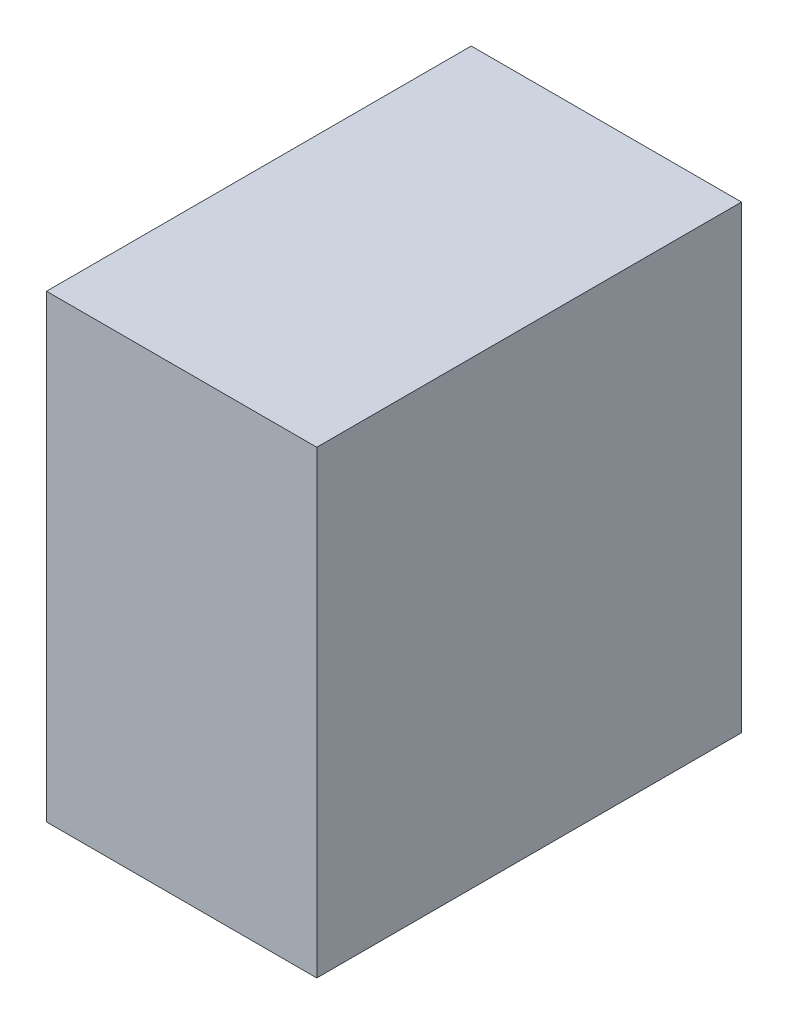
ISO-10303-21;
HEADER;
FILE_DESCRIPTION(('STEP AP214'),'2;1');
FILE_NAME('part.step','',(''),(''),'','','');
FILE_SCHEMA(('AUTOMOTIVE_DESIGN { 1 0 10303 214 1 1 1 1 }'));
ENDSEC;
DATA;
#1=APPLICATION_CONTEXT('core data for automotive mechanical design processes');
#2=APPLICATION_PROTOCOL_DEFINITION('international standard','automotive_design',2000,#1);
#3=PRODUCT_CONTEXT('',#1,'mechanical');
#4=PRODUCT('Part','Part','',(#3));
#5=PRODUCT_RELATED_PRODUCT_CATEGORY('part','',(#4));
#6=PRODUCT_DEFINITION_FORMATION('','',#4);
#7=PRODUCT_DEFINITION_CONTEXT('part definition',#1,'design');
#8=PRODUCT_DEFINITION('design','',#6,#7);
#9=PRODUCT_DEFINITION_SHAPE('','',#8);
#10=(LENGTH_UNIT() NAMED_UNIT(*) SI_UNIT(.MILLI.,.METRE.));
#11=(NAMED_UNIT(*) PLANE_ANGLE_UNIT() SI_UNIT($,.RADIAN.));
#12=(NAMED_UNIT(*) SI_UNIT($,.STERADIAN.) SOLID_ANGLE_UNIT());
#13=UNCERTAINTY_MEASURE_WITH_UNIT(LENGTH_MEASURE(1.E-05),#10,'distance_accuracy_value','');
#14=(GEOMETRIC_REPRESENTATION_CONTEXT(3) GLOBAL_UNCERTAINTY_ASSIGNED_CONTEXT((#13)) GLOBAL_UNIT_ASSIGNED_CONTEXT((#10,
#11,#12)) REPRESENTATION_CONTEXT('',''));
#15=CARTESIAN_POINT('',(0.,0.,0.));
#16=DIRECTION('',(0.,0.,1.));
#17=DIRECTION('',(1.,0.,0.));
#18=AXIS2_PLACEMENT_3D('',#15,#16,#17);
#19=CARTESIAN_POINT('',(40.3,20.3220000107563,7.27));
#20=DIRECTION('',(1.,0.,0.));
#21=DIRECTION('',(0.,1.,0.));
#22=AXIS2_PLACEMENT_3D('',#19,#20,#21);
#23=PLANE('',#22);
#24=DIRECTION('',(0.,0.,1.));
#25=VECTOR('',#24,1.);
#26=CARTESIAN_POINT('',(40.3,12.3220000107563,15.3525));
#27=LINE('',#26,#25);
#28=CARTESIAN_POINT('',(40.3,12.3220000107563,7.27));
#29=VERTEX_POINT('',#28);
#30=CARTESIAN_POINT('',(40.3,12.3220000107563,17.27));
#31=VERTEX_POINT('',#30);
#32=EDGE_CURVE('E80',#29,#31,#27,.T.);
#33=ORIENTED_EDGE('',*,*,#32,.T.);
#34=DIRECTION('',(0.,-1.,0.));
#35=VECTOR('',#34,1.);
#36=CARTESIAN_POINT('',(40.3,20.3220000107563,17.27));
#37=LINE('',#36,#35);
#38=CARTESIAN_POINT('',(40.3,1.49999995944139,17.27));
#39=VERTEX_POINT('',#38);
#40=EDGE_CURVE('E11',#31,#39,#37,.T.);
#41=ORIENTED_EDGE('',*,*,#40,.T.);
#42=DIRECTION('',(0.,0.,1.));
#43=VECTOR('',#42,1.);
#44=CARTESIAN_POINT('',(40.3,1.5,3.635));
#45=LINE('',#44,#43);
#46=CARTESIAN_POINT('',(40.3,1.49999995944139,7.27));
#47=VERTEX_POINT('',#46);
#48=EDGE_CURVE('E83',#47,#39,#45,.T.);
#49=ORIENTED_EDGE('',*,*,#48,.F.);
#50=DIRECTION('',(0.,-1.,0.));
#51=VECTOR('',#50,1.);
#52=CARTESIAN_POINT('',(40.3,20.3220000107563,7.27));
#53=LINE('',#52,#51);
#54=EDGE_CURVE('E27',#29,#47,#53,.T.);
#55=ORIENTED_EDGE('',*,*,#54,.F.);
#56=EDGE_LOOP('',(#33,#41,#49,#55));
#57=FACE_BOUND('',#56,.T.);
#58=ADVANCED_FACE('F16',(#57),#23,.T.);
#59=CARTESIAN_POINT('',(40.3,20.3220000107563,17.27));
#60=DIRECTION('',(0.,0.,1.));
#61=DIRECTION('',(0.,-1.,0.));
#62=AXIS2_PLACEMENT_3D('',#59,#60,#61);
#63=PLANE('',#62);
#64=DIRECTION('',(-1.,0.,0.));
#65=VECTOR('',#64,1.);
#66=CARTESIAN_POINT('',(39.2847851604859,12.3220000107563,17.27));
#67=LINE('',#66,#65);
#68=CARTESIAN_POINT('',(33.9369990081897,12.3220000107563,17.27));
#69=VERTEX_POINT('',#68);
#70=EDGE_CURVE('E90',#31,#69,#67,.T.);
#71=ORIENTED_EDGE('',*,*,#70,.T.);
#72=DIRECTION('',(0.,-1.,0.));
#73=VECTOR('',#72,1.);
#74=CARTESIAN_POINT('',(33.9369990081897,20.3220000107563,17.27));
#75=LINE('',#74,#73);
#76=CARTESIAN_POINT('',(33.9369990081897,1.49999995944139,17.27));
#77=VERTEX_POINT('',#76);
#78=EDGE_CURVE('E52',#69,#77,#75,.T.);
#79=ORIENTED_EDGE('',*,*,#78,.T.);
#80=DIRECTION('',(-1.,0.,0.));
#81=VECTOR('',#80,1.);
#82=CARTESIAN_POINT('',(20.15,1.5,17.27));
#83=LINE('',#82,#81);
#84=EDGE_CURVE('E96',#39,#77,#83,.T.);
#85=ORIENTED_EDGE('',*,*,#84,.F.);
#86=ORIENTED_EDGE('',*,*,#40,.F.);
#87=EDGE_LOOP('',(#71,#79,#85,#86));
#88=FACE_BOUND('',#87,.T.);
#89=ADVANCED_FACE('F122',(#88),#63,.T.);
#90=CARTESIAN_POINT('',(33.9369990081897,20.3220000107563,7.27));
#91=DIRECTION('',(0.,0.,-1.));
#92=DIRECTION('',(0.,-1.,0.));
#93=AXIS2_PLACEMENT_3D('',#90,#91,#92);
#94=PLANE('',#93);
#95=DIRECTION('',(1.,0.,0.));
#96=VECTOR('',#95,1.);
#97=CARTESIAN_POINT('',(36.1032846645808,12.3220000107563,7.27));
#98=LINE('',#97,#96);
#99=CARTESIAN_POINT('',(33.9369990081897,12.3220000107563,7.27));
#100=VERTEX_POINT('',#99);
#101=EDGE_CURVE('E89',#100,#29,#98,.T.);
#102=ORIENTED_EDGE('',*,*,#101,.T.);
#103=ORIENTED_EDGE('',*,*,#54,.T.);
#104=DIRECTION('',(1.,0.,0.));
#105=VECTOR('',#104,1.);
#106=CARTESIAN_POINT('',(16.9684995040948,1.5,7.27));
#107=LINE('',#106,#105);
#108=CARTESIAN_POINT('',(33.9369990081897,1.49999995944138,7.27));
#109=VERTEX_POINT('',#108);
#110=EDGE_CURVE('E112',#109,#47,#107,.T.);
#111=ORIENTED_EDGE('',*,*,#110,.F.);
#112=DIRECTION('',(0.,-1.,0.));
#113=VECTOR('',#112,1.);
#114=CARTESIAN_POINT('',(33.9369990081897,20.3220000107563,7.27));
#115=LINE('',#114,#113);
#116=EDGE_CURVE('E65',#100,#109,#115,.T.);
#117=ORIENTED_EDGE('',*,*,#116,.F.);
#118=EDGE_LOOP('',(#102,#103,#111,#117));
#119=FACE_BOUND('',#118,.T.);
#120=ADVANCED_FACE('F93',(#119),#94,.T.);
#121=CARTESIAN_POINT('',(33.9369990081897,20.3220000107563,17.27));
#122=DIRECTION('',(-1.,0.,0.));
#123=DIRECTION('',(0.,1.,0.));
#124=AXIS2_PLACEMENT_3D('',#121,#122,#123);
#125=PLANE('',#124);
#126=DIRECTION('',(0.,0.,-1.));
#127=VECTOR('',#126,1.);
#128=CARTESIAN_POINT('',(33.9369990081897,12.3220000107563,20.3525));
#129=LINE('',#128,#127);
#130=EDGE_CURVE('E95',#69,#100,#129,.T.);
#131=ORIENTED_EDGE('',*,*,#130,.T.);
#132=ORIENTED_EDGE('',*,*,#116,.T.);
#133=DIRECTION('',(0.,0.,-1.));
#134=VECTOR('',#133,1.);
#135=CARTESIAN_POINT('',(33.9369990081897,1.5,8.635));
#136=LINE('',#135,#134);
#137=EDGE_CURVE('E20',#77,#109,#136,.T.);
#138=ORIENTED_EDGE('',*,*,#137,.F.);
#139=ORIENTED_EDGE('',*,*,#78,.F.);
#140=EDGE_LOOP('',(#131,#132,#138,#139));
#141=FACE_BOUND('',#140,.T.);
#142=ADVANCED_FACE('F121',(#141),#125,.T.);
#143=CARTESIAN_POINT('',(38.2695703209719,12.3220000107563,23.435));
#144=DIRECTION('',(0.,-1.,0.));
#145=DIRECTION('',(0.,0.,-1.));
#146=AXIS2_PLACEMENT_3D('',#143,#144,#145);
#147=PLANE('',#146);
#148=ORIENTED_EDGE('',*,*,#101,.F.);
#149=ORIENTED_EDGE('',*,*,#130,.F.);
#150=ORIENTED_EDGE('',*,*,#70,.F.);
#151=ORIENTED_EDGE('',*,*,#32,.F.);
#152=EDGE_LOOP('',(#148,#149,#150,#151));
#153=FACE_BOUND('',#152,.T.);
#154=ADVANCED_FACE('F18',(#153),#147,.F.);
#155=CARTESIAN_POINT('',(-0.14892918312297,1.49999995944139,0.));
#156=DIRECTION('',(0.,-1.,0.));
#157=DIRECTION('',(0.,0.,-1.));
#158=AXIS2_PLACEMENT_3D('',#155,#156,#157);
#159=PLANE('',#158);
#160=ORIENTED_EDGE('',*,*,#137,.T.);
#161=ORIENTED_EDGE('',*,*,#110,.T.);
#162=ORIENTED_EDGE('',*,*,#48,.T.);
#163=ORIENTED_EDGE('',*,*,#84,.T.);
#164=EDGE_LOOP('',(#160,#161,#162,#163));
#165=FACE_BOUND('',#164,.T.);
#166=ADVANCED_FACE('F120',(#165),#159,.T.);
#167=CLOSED_SHELL('',(#58,#89,#120,#142,#154,#166));
#168=MANIFOLD_SOLID_BREP('B1',#167);
#169=ADVANCED_BREP_SHAPE_REPRESENTATION('',(#18,#168),#14);
#170=SHAPE_DEFINITION_REPRESENTATION(#9,#169);
ENDSEC;
END-ISO-10303-21;
